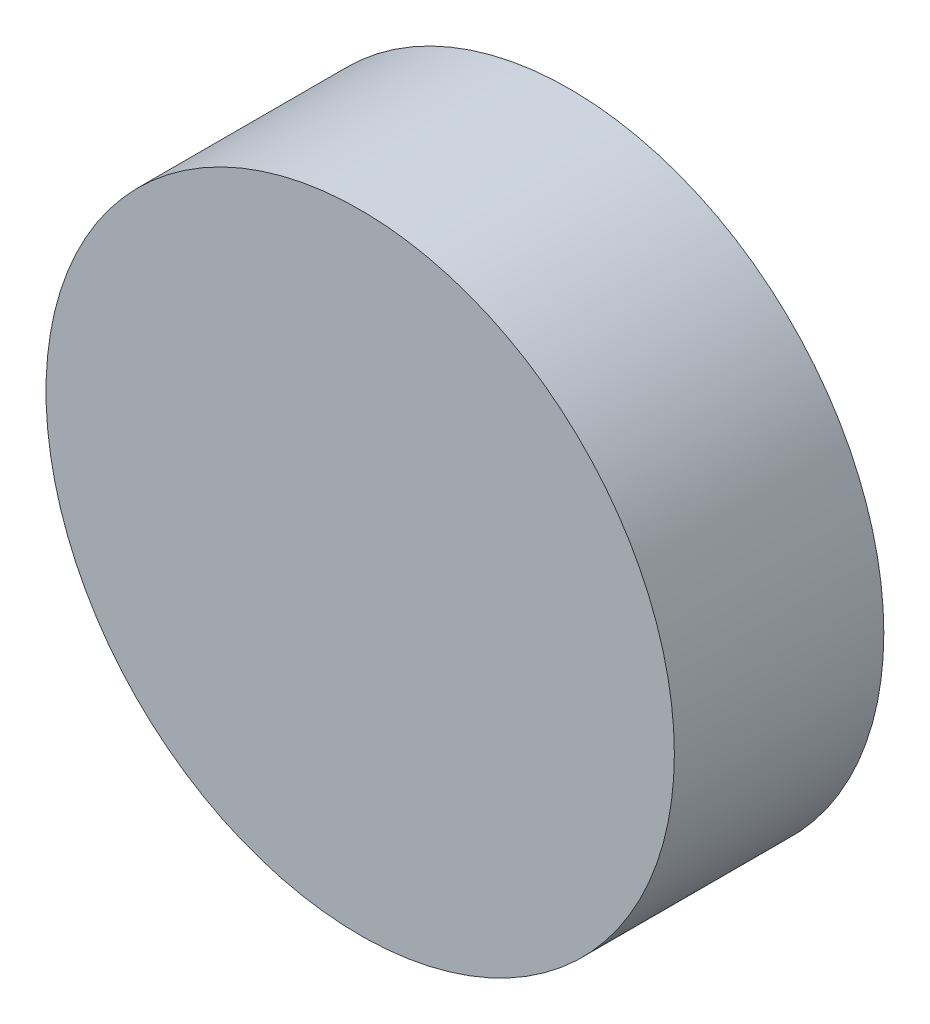
ISO-10303-21;
HEADER;
FILE_DESCRIPTION(('STEP AP214'),'2;1');
FILE_NAME('part.step','',(''),(''),'','','');
FILE_SCHEMA(('AUTOMOTIVE_DESIGN { 1 0 10303 214 1 1 1 1 }'));
ENDSEC;
DATA;
#1=APPLICATION_CONTEXT('core data for automotive mechanical design processes');
#2=APPLICATION_PROTOCOL_DEFINITION('international standard','automotive_design',2000,#1);
#3=PRODUCT_CONTEXT('',#1,'mechanical');
#4=PRODUCT('Part','Part','',(#3));
#5=PRODUCT_RELATED_PRODUCT_CATEGORY('part','',(#4));
#6=PRODUCT_DEFINITION_FORMATION('','',#4);
#7=PRODUCT_DEFINITION_CONTEXT('part definition',#1,'design');
#8=PRODUCT_DEFINITION('design','',#6,#7);
#9=PRODUCT_DEFINITION_SHAPE('','',#8);
#10=(LENGTH_UNIT() NAMED_UNIT(*) SI_UNIT(.MILLI.,.METRE.));
#11=(NAMED_UNIT(*) PLANE_ANGLE_UNIT() SI_UNIT($,.RADIAN.));
#12=(NAMED_UNIT(*) SI_UNIT($,.STERADIAN.) SOLID_ANGLE_UNIT());
#13=UNCERTAINTY_MEASURE_WITH_UNIT(LENGTH_MEASURE(1.E-05),#10,'distance_accuracy_value','');
#14=(GEOMETRIC_REPRESENTATION_CONTEXT(3) GLOBAL_UNCERTAINTY_ASSIGNED_CONTEXT((#13)) GLOBAL_UNIT_ASSIGNED_CONTEXT((#10,
#11,#12)) REPRESENTATION_CONTEXT('',''));
#15=CARTESIAN_POINT('',(0.,0.,0.));
#16=DIRECTION('',(0.,0.,1.));
#17=DIRECTION('',(1.,0.,0.));
#18=AXIS2_PLACEMENT_3D('',#15,#16,#17);
#19=CARTESIAN_POINT('',(0.,0.,40.));
#20=DIRECTION('',(0.,0.,-1.));
#21=DIRECTION('',(-1.,0.,0.));
#22=AXIS2_PLACEMENT_3D('',#19,#20,#21);
#23=CYLINDRICAL_SURFACE('',#22,60.);
#24=CARTESIAN_POINT('',(0.,0.,40.));
#25=DIRECTION('',(0.,0.,1.));
#26=DIRECTION('',(1.,0.,0.));
#27=AXIS2_PLACEMENT_3D('',#24,#25,#26);
#28=CIRCLE('',#27,60.);
#29=CARTESIAN_POINT('',(60.,0.,40.));
#30=VERTEX_POINT('',#29);
#31=EDGE_CURVE('E10',#30,#30,#28,.T.);
#32=ORIENTED_EDGE('',*,*,#31,.F.);
#33=EDGE_LOOP('',(#32));
#34=FACE_BOUND('',#33,.T.);
#35=CARTESIAN_POINT('',(0.,0.,0.));
#36=DIRECTION('',(0.,0.,1.));
#37=DIRECTION('',(1.,0.,0.));
#38=AXIS2_PLACEMENT_3D('',#35,#36,#37);
#39=CIRCLE('',#38,60.);
#40=CARTESIAN_POINT('',(60.,0.,0.));
#41=VERTEX_POINT('',#40);
#42=EDGE_CURVE('E46',#41,#41,#39,.T.);
#43=ORIENTED_EDGE('',*,*,#42,.T.);
#44=EDGE_LOOP('',(#43));
#45=FACE_BOUND('',#44,.T.);
#46=ADVANCED_FACE('F43',(#34,#45),#23,.T.);
#47=CARTESIAN_POINT('',(0.,0.,40.));
#48=DIRECTION('',(0.,0.,1.));
#49=DIRECTION('',(1.,0.,0.));
#50=AXIS2_PLACEMENT_3D('',#47,#48,#49);
#51=PLANE('',#50);
#52=ORIENTED_EDGE('',*,*,#31,.T.);
#53=EDGE_LOOP('',(#52));
#54=FACE_BOUND('',#53,.T.);
#55=ADVANCED_FACE('F60',(#54),#51,.T.);
#56=CARTESIAN_POINT('',(0.,0.,0.));
#57=DIRECTION('',(0.,0.,1.));
#58=DIRECTION('',(1.,0.,0.));
#59=AXIS2_PLACEMENT_3D('',#56,#57,#58);
#60=PLANE('',#59);
#61=ORIENTED_EDGE('',*,*,#42,.F.);
#62=EDGE_LOOP('',(#61));
#63=FACE_BOUND('',#62,.T.);
#64=ADVANCED_FACE('F58',(#63),#60,.F.);
#65=CLOSED_SHELL('',(#46,#55,#64));
#66=MANIFOLD_SOLID_BREP('B2',#65);
#67=ADVANCED_BREP_SHAPE_REPRESENTATION('',(#18,#66),#14);
#68=SHAPE_DEFINITION_REPRESENTATION(#9,#67);
ENDSEC;
END-ISO-10303-21;
